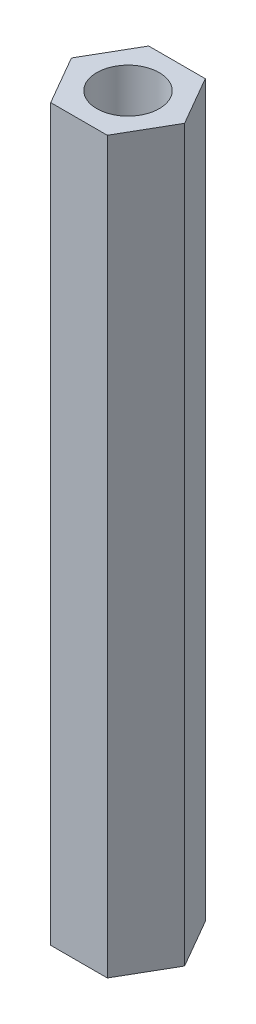
ISO-10303-21;
HEADER;
FILE_DESCRIPTION(('STEP AP214'),'2;1');
FILE_NAME('part.step','',(''),(''),'','','');
FILE_SCHEMA(('AUTOMOTIVE_DESIGN { 1 0 10303 214 1 1 1 1 }'));
ENDSEC;
DATA;
#1=APPLICATION_CONTEXT('core data for automotive mechanical design processes');
#2=APPLICATION_PROTOCOL_DEFINITION('international standard','automotive_design',2000,#1);
#3=PRODUCT_CONTEXT('',#1,'mechanical');
#4=PRODUCT('Part','Part','',(#3));
#5=PRODUCT_RELATED_PRODUCT_CATEGORY('part','',(#4));
#6=PRODUCT_DEFINITION_FORMATION('','',#4);
#7=PRODUCT_DEFINITION_CONTEXT('part definition',#1,'design');
#8=PRODUCT_DEFINITION('design','',#6,#7);
#9=PRODUCT_DEFINITION_SHAPE('','',#8);
#10=(LENGTH_UNIT() NAMED_UNIT(*) SI_UNIT(.MILLI.,.METRE.));
#11=(NAMED_UNIT(*) PLANE_ANGLE_UNIT() SI_UNIT($,.RADIAN.));
#12=(NAMED_UNIT(*) SI_UNIT($,.STERADIAN.) SOLID_ANGLE_UNIT());
#13=UNCERTAINTY_MEASURE_WITH_UNIT(LENGTH_MEASURE(1.E-05),#10,'distance_accuracy_value','');
#14=(GEOMETRIC_REPRESENTATION_CONTEXT(3) GLOBAL_UNCERTAINTY_ASSIGNED_CONTEXT((#13)) GLOBAL_UNIT_ASSIGNED_CONTEXT((#10,
#11,#12)) REPRESENTATION_CONTEXT('',''));
#15=CARTESIAN_POINT('',(0.,0.,0.));
#16=DIRECTION('',(0.,0.,1.));
#17=DIRECTION('',(1.,0.,0.));
#18=AXIS2_PLACEMENT_3D('',#15,#16,#17);
#19=CARTESIAN_POINT('',(0.,35.,0.));
#20=DIRECTION('',(0.,1.,0.));
#21=DIRECTION('',(0.,0.,1.));
#22=AXIS2_PLACEMENT_3D('',#19,#20,#21);
#23=PLANE('',#22);
#24=DIRECTION('',(0.499999999999995,0.,-0.866025403784441));
#25=VECTOR('',#24,1.);
#26=CARTESIAN_POINT('',(1.35677313259565,35.,2.34999999999999));
#27=LINE('',#26,#25);
#28=CARTESIAN_POINT('',(1.35677313259565,35.,2.34999999999999));
#29=VERTEX_POINT('',#28);
#30=CARTESIAN_POINT('',(2.71354626519124,35.,0.));
#31=VERTEX_POINT('',#30);
#32=EDGE_CURVE('E131',#29,#31,#27,.T.);
#33=ORIENTED_EDGE('',*,*,#32,.T.);
#34=DIRECTION('',(-0.500000000000001,0.,-0.866025403784438));
#35=VECTOR('',#34,1.);
#36=CARTESIAN_POINT('',(2.71354626519124,35.,0.));
#37=LINE('',#36,#35);
#38=CARTESIAN_POINT('',(1.35677313259562,35.,-2.35));
#39=VERTEX_POINT('',#38);
#40=EDGE_CURVE('E89',#31,#39,#37,.T.);
#41=ORIENTED_EDGE('',*,*,#40,.T.);
#42=DIRECTION('',(-1.,0.,0.));
#43=VECTOR('',#42,1.);
#44=CARTESIAN_POINT('',(1.35677313259562,35.,-2.35));
#45=LINE('',#44,#43);
#46=CARTESIAN_POINT('',(-1.35677313259563,35.,-2.35));
#47=VERTEX_POINT('',#46);
#48=EDGE_CURVE('E102',#39,#47,#45,.T.);
#49=ORIENTED_EDGE('',*,*,#48,.T.);
#50=DIRECTION('',(-0.499999999999995,0.,0.866025403784441));
#51=VECTOR('',#50,1.);
#52=CARTESIAN_POINT('',(-1.35677313259563,35.,-2.35));
#53=LINE('',#52,#51);
#54=CARTESIAN_POINT('',(-2.71354626519124,35.,0.));
#55=VERTEX_POINT('',#54);
#56=EDGE_CURVE('E96',#47,#55,#53,.T.);
#57=ORIENTED_EDGE('',*,*,#56,.T.);
#58=DIRECTION('',(0.500000000000007,0.,0.866025403784435));
#59=VECTOR('',#58,1.);
#60=CARTESIAN_POINT('',(-2.71354626519124,35.,0.));
#61=LINE('',#60,#59);
#62=CARTESIAN_POINT('',(-1.3567731325956,35.,2.35000000000001));
#63=VERTEX_POINT('',#62);
#64=EDGE_CURVE('E100',#55,#63,#61,.T.);
#65=ORIENTED_EDGE('',*,*,#64,.T.);
#66=DIRECTION('',(1.,0.,0.));
#67=VECTOR('',#66,1.);
#68=CARTESIAN_POINT('',(-1.3567731325956,35.,2.35000000000001));
#69=LINE('',#68,#67);
#70=EDGE_CURVE('E52',#63,#29,#69,.T.);
#71=ORIENTED_EDGE('',*,*,#70,.T.);
#72=EDGE_LOOP('',(#33,#41,#49,#57,#65,#71));
#73=FACE_BOUND('',#72,.T.);
#74=CARTESIAN_POINT('',(0.,35.,0.));
#75=DIRECTION('',(0.,1.,0.));
#76=DIRECTION('',(0.,0.,1.));
#77=AXIS2_PLACEMENT_3D('',#74,#75,#76);
#78=CIRCLE('',#77,1.5);
#79=CARTESIAN_POINT('',(0.,35.,1.5));
#80=VERTEX_POINT('',#79);
#81=EDGE_CURVE('E124',#80,#80,#78,.T.);
#82=ORIENTED_EDGE('',*,*,#81,.F.);
#83=EDGE_LOOP('',(#82));
#84=FACE_BOUND('',#83,.T.);
#85=ADVANCED_FACE('F35',(#73,#84),#23,.T.);
#86=CARTESIAN_POINT('',(0.,0.,0.));
#87=DIRECTION('',(0.,1.,0.));
#88=DIRECTION('',(0.,0.,1.));
#89=AXIS2_PLACEMENT_3D('',#86,#87,#88);
#90=PLANE('',#89);
#91=DIRECTION('',(0.499999999999995,0.,-0.866025403784441));
#92=VECTOR('',#91,1.);
#93=CARTESIAN_POINT('',(1.35677313259565,0.,2.34999999999999));
#94=LINE('',#93,#92);
#95=CARTESIAN_POINT('',(1.35677313259565,0.,2.34999999999999));
#96=VERTEX_POINT('',#95);
#97=CARTESIAN_POINT('',(2.71354626519124,0.,0.));
#98=VERTEX_POINT('',#97);
#99=EDGE_CURVE('E120',#96,#98,#94,.T.);
#100=ORIENTED_EDGE('',*,*,#99,.F.);
#101=DIRECTION('',(1.,0.,0.));
#102=VECTOR('',#101,1.);
#103=CARTESIAN_POINT('',(-1.3567731325956,0.,2.35000000000001));
#104=LINE('',#103,#102);
#105=CARTESIAN_POINT('',(-1.3567731325956,0.,2.35000000000001));
#106=VERTEX_POINT('',#105);
#107=EDGE_CURVE('E81',#106,#96,#104,.T.);
#108=ORIENTED_EDGE('',*,*,#107,.F.);
#109=DIRECTION('',(0.500000000000007,0.,0.866025403784435));
#110=VECTOR('',#109,1.);
#111=CARTESIAN_POINT('',(-2.71354626519124,0.,0.));
#112=LINE('',#111,#110);
#113=CARTESIAN_POINT('',(-2.71354626519124,0.,0.));
#114=VERTEX_POINT('',#113);
#115=EDGE_CURVE('E75',#114,#106,#112,.T.);
#116=ORIENTED_EDGE('',*,*,#115,.F.);
#117=DIRECTION('',(-0.499999999999995,0.,0.866025403784441));
#118=VECTOR('',#117,1.);
#119=CARTESIAN_POINT('',(-1.35677313259563,0.,-2.35));
#120=LINE('',#119,#118);
#121=CARTESIAN_POINT('',(-1.35677313259563,0.,-2.35));
#122=VERTEX_POINT('',#121);
#123=EDGE_CURVE('E110',#122,#114,#120,.T.);
#124=ORIENTED_EDGE('',*,*,#123,.F.);
#125=DIRECTION('',(-1.,0.,0.));
#126=VECTOR('',#125,1.);
#127=CARTESIAN_POINT('',(1.35677313259562,0.,-2.35));
#128=LINE('',#127,#126);
#129=CARTESIAN_POINT('',(1.35677313259562,0.,-2.35));
#130=VERTEX_POINT('',#129);
#131=EDGE_CURVE('E126',#130,#122,#128,.T.);
#132=ORIENTED_EDGE('',*,*,#131,.F.);
#133=DIRECTION('',(-0.500000000000001,0.,-0.866025403784438));
#134=VECTOR('',#133,1.);
#135=CARTESIAN_POINT('',(2.71354626519124,0.,0.));
#136=LINE('',#135,#134);
#137=EDGE_CURVE('E123',#98,#130,#136,.T.);
#138=ORIENTED_EDGE('',*,*,#137,.F.);
#139=EDGE_LOOP('',(#100,#108,#116,#124,#132,#138));
#140=FACE_BOUND('',#139,.T.);
#141=CARTESIAN_POINT('',(0.,0.,0.));
#142=DIRECTION('',(0.,1.,0.));
#143=DIRECTION('',(0.,0.,1.));
#144=AXIS2_PLACEMENT_3D('',#141,#142,#143);
#145=CIRCLE('',#144,1.5);
#146=CARTESIAN_POINT('',(0.,0.,1.5));
#147=VERTEX_POINT('',#146);
#148=EDGE_CURVE('E224',#147,#147,#145,.T.);
#149=ORIENTED_EDGE('',*,*,#148,.T.);
#150=EDGE_LOOP('',(#149));
#151=FACE_BOUND('',#150,.T.);
#152=ADVANCED_FACE('F140',(#140,#151),#90,.F.);
#153=CARTESIAN_POINT('',(1.35677313259565,35.,2.34999999999999));
#154=DIRECTION('',(-0.866025403784441,0.,-0.499999999999995));
#155=DIRECTION('',(-0.499999999999995,0.,0.866025403784441));
#156=AXIS2_PLACEMENT_3D('',#153,#154,#155);
#157=PLANE('',#156);
#158=ORIENTED_EDGE('',*,*,#99,.T.);
#159=DIRECTION('',(0.,-1.,0.));
#160=VECTOR('',#159,1.);
#161=CARTESIAN_POINT('',(2.71354626519124,35.,0.));
#162=LINE('',#161,#160);
#163=EDGE_CURVE('E11',#31,#98,#162,.T.);
#164=ORIENTED_EDGE('',*,*,#163,.F.);
#165=ORIENTED_EDGE('',*,*,#32,.F.);
#166=DIRECTION('',(0.,-1.,0.));
#167=VECTOR('',#166,1.);
#168=CARTESIAN_POINT('',(1.35677313259565,35.,2.34999999999999));
#169=LINE('',#168,#167);
#170=EDGE_CURVE('E116',#29,#96,#169,.T.);
#171=ORIENTED_EDGE('',*,*,#170,.T.);
#172=EDGE_LOOP('',(#158,#164,#165,#171));
#173=FACE_BOUND('',#172,.T.);
#174=ADVANCED_FACE('F37',(#173),#157,.F.);
#175=CARTESIAN_POINT('',(2.71354626519124,35.,0.));
#176=DIRECTION('',(-0.866025403784438,0.,0.500000000000001));
#177=DIRECTION('',(0.500000000000001,0.,0.866025403784438));
#178=AXIS2_PLACEMENT_3D('',#175,#176,#177);
#179=PLANE('',#178);
#180=ORIENTED_EDGE('',*,*,#137,.T.);
#181=DIRECTION('',(0.,-1.,0.));
#182=VECTOR('',#181,1.);
#183=CARTESIAN_POINT('',(1.35677313259562,35.,-2.35));
#184=LINE('',#183,#182);
#185=EDGE_CURVE('E44',#39,#130,#184,.T.);
#186=ORIENTED_EDGE('',*,*,#185,.F.);
#187=ORIENTED_EDGE('',*,*,#40,.F.);
#188=ORIENTED_EDGE('',*,*,#163,.T.);
#189=EDGE_LOOP('',(#180,#186,#187,#188));
#190=FACE_BOUND('',#189,.T.);
#191=ADVANCED_FACE('F165',(#190),#179,.F.);
#192=CARTESIAN_POINT('',(1.35677313259562,35.,-2.35));
#193=DIRECTION('',(0.,0.,1.));
#194=DIRECTION('',(1.,0.,0.));
#195=AXIS2_PLACEMENT_3D('',#192,#193,#194);
#196=PLANE('',#195);
#197=ORIENTED_EDGE('',*,*,#131,.T.);
#198=DIRECTION('',(0.,-1.,0.));
#199=VECTOR('',#198,1.);
#200=CARTESIAN_POINT('',(-1.35677313259563,35.,-2.35));
#201=LINE('',#200,#199);
#202=EDGE_CURVE('E111',#47,#122,#201,.T.);
#203=ORIENTED_EDGE('',*,*,#202,.F.);
#204=ORIENTED_EDGE('',*,*,#48,.F.);
#205=ORIENTED_EDGE('',*,*,#185,.T.);
#206=EDGE_LOOP('',(#197,#203,#204,#205));
#207=FACE_BOUND('',#206,.T.);
#208=ADVANCED_FACE('F137',(#207),#196,.F.);
#209=CARTESIAN_POINT('',(-1.35677313259563,35.,-2.35));
#210=DIRECTION('',(0.866025403784442,0.,0.499999999999995));
#211=DIRECTION('',(0.499999999999995,0.,-0.866025403784442));
#212=AXIS2_PLACEMENT_3D('',#209,#210,#211);
#213=PLANE('',#212);
#214=ORIENTED_EDGE('',*,*,#123,.T.);
#215=DIRECTION('',(0.,-1.,0.));
#216=VECTOR('',#215,1.);
#217=CARTESIAN_POINT('',(-2.71354626519124,35.,0.));
#218=LINE('',#217,#216);
#219=EDGE_CURVE('E107',#55,#114,#218,.T.);
#220=ORIENTED_EDGE('',*,*,#219,.F.);
#221=ORIENTED_EDGE('',*,*,#56,.F.);
#222=ORIENTED_EDGE('',*,*,#202,.T.);
#223=EDGE_LOOP('',(#214,#220,#221,#222));
#224=FACE_BOUND('',#223,.T.);
#225=ADVANCED_FACE('F108',(#224),#213,.F.);
#226=CARTESIAN_POINT('',(-2.71354626519124,35.,0.));
#227=DIRECTION('',(0.866025403784435,0.,-0.500000000000007));
#228=DIRECTION('',(-0.500000000000007,0.,-0.866025403784435));
#229=AXIS2_PLACEMENT_3D('',#226,#227,#228);
#230=PLANE('',#229);
#231=ORIENTED_EDGE('',*,*,#115,.T.);
#232=DIRECTION('',(0.,-1.,0.));
#233=VECTOR('',#232,1.);
#234=CARTESIAN_POINT('',(-1.3567731325956,35.,2.35000000000001));
#235=LINE('',#234,#233);
#236=EDGE_CURVE('E112',#63,#106,#235,.T.);
#237=ORIENTED_EDGE('',*,*,#236,.F.);
#238=ORIENTED_EDGE('',*,*,#64,.F.);
#239=ORIENTED_EDGE('',*,*,#219,.T.);
#240=EDGE_LOOP('',(#231,#237,#238,#239));
#241=FACE_BOUND('',#240,.T.);
#242=ADVANCED_FACE('F114',(#241),#230,.F.);
#243=CARTESIAN_POINT('',(-1.3567731325956,35.,2.35000000000001));
#244=DIRECTION('',(0.,0.,-1.));
#245=DIRECTION('',(-1.,0.,0.));
#246=AXIS2_PLACEMENT_3D('',#243,#244,#245);
#247=PLANE('',#246);
#248=ORIENTED_EDGE('',*,*,#107,.T.);
#249=ORIENTED_EDGE('',*,*,#170,.F.);
#250=ORIENTED_EDGE('',*,*,#70,.F.);
#251=ORIENTED_EDGE('',*,*,#236,.T.);
#252=EDGE_LOOP('',(#248,#249,#250,#251));
#253=FACE_BOUND('',#252,.T.);
#254=ADVANCED_FACE('F145',(#253),#247,.F.);
#255=CARTESIAN_POINT('',(0.,35.,0.));
#256=DIRECTION('',(0.,-1.,0.));
#257=DIRECTION('',(0.,0.,-1.));
#258=AXIS2_PLACEMENT_3D('',#255,#256,#257);
#259=CYLINDRICAL_SURFACE('',#258,1.5);
#260=ORIENTED_EDGE('',*,*,#81,.T.);
#261=EDGE_LOOP('',(#260));
#262=FACE_BOUND('',#261,.T.);
#263=ORIENTED_EDGE('',*,*,#148,.F.);
#264=EDGE_LOOP('',(#263));
#265=FACE_BOUND('',#264,.T.);
#266=ADVANCED_FACE('F147',(#262,#265),#259,.F.);
#267=CLOSED_SHELL('',(#85,#152,#174,#191,#208,#225,#242,#254,#266));
#268=MANIFOLD_SOLID_BREP('B2',#267);
#269=ADVANCED_BREP_SHAPE_REPRESENTATION('',(#18,#268),#14);
#270=SHAPE_DEFINITION_REPRESENTATION(#9,#269);
ENDSEC;
END-ISO-10303-21;
